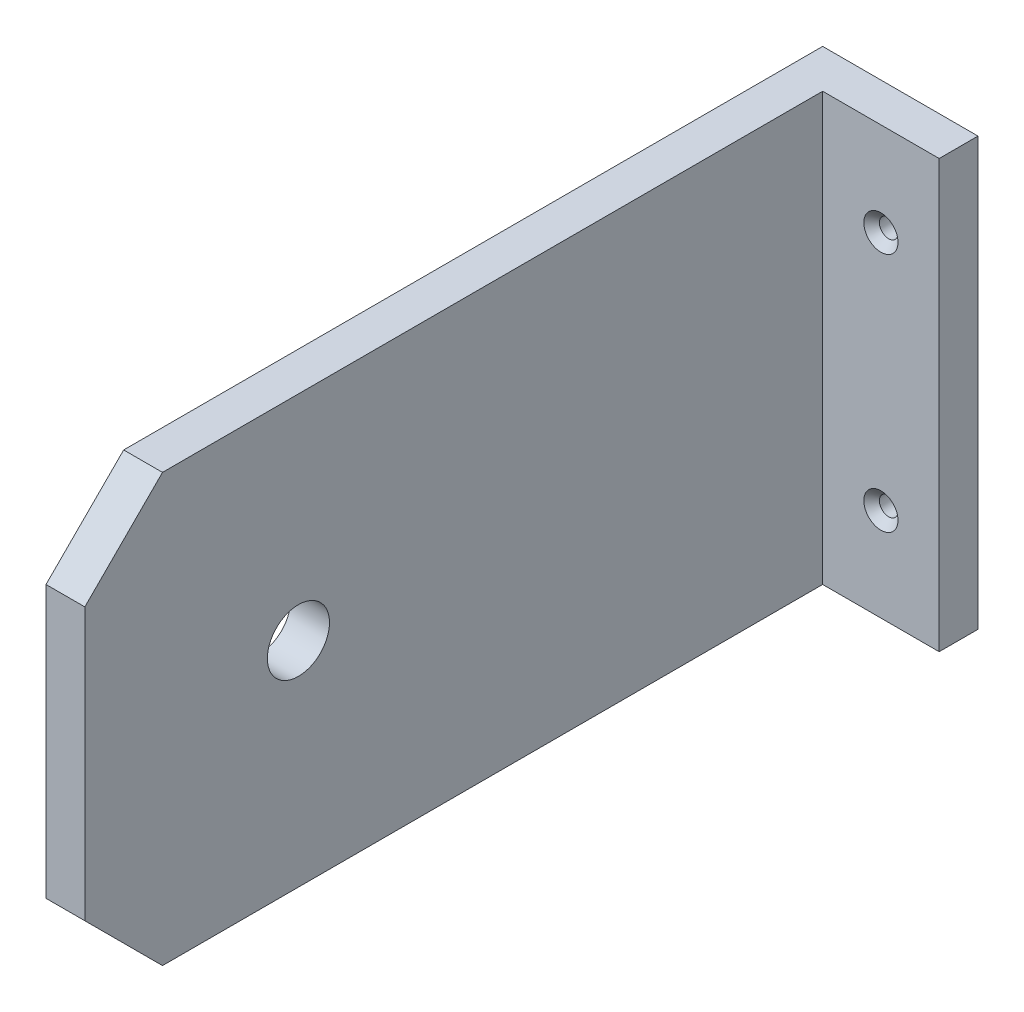
ISO-10303-21;
HEADER;
FILE_DESCRIPTION(('STEP AP214'),'2;1');
FILE_NAME('part.step','',(''),(''),'','','');
FILE_SCHEMA(('AUTOMOTIVE_DESIGN { 1 0 10303 214 1 1 1 1 }'));
ENDSEC;
DATA;
#1=APPLICATION_CONTEXT('core data for automotive mechanical design processes');
#2=APPLICATION_PROTOCOL_DEFINITION('international standard','automotive_design',2000,#1);
#3=PRODUCT_CONTEXT('',#1,'mechanical');
#4=PRODUCT('Part','Part','',(#3));
#5=PRODUCT_RELATED_PRODUCT_CATEGORY('part','',(#4));
#6=PRODUCT_DEFINITION_FORMATION('','',#4);
#7=PRODUCT_DEFINITION_CONTEXT('part definition',#1,'design');
#8=PRODUCT_DEFINITION('design','',#6,#7);
#9=PRODUCT_DEFINITION_SHAPE('','',#8);
#10=(LENGTH_UNIT() NAMED_UNIT(*) SI_UNIT(.MILLI.,.METRE.));
#11=(NAMED_UNIT(*) PLANE_ANGLE_UNIT() SI_UNIT($,.RADIAN.));
#12=(NAMED_UNIT(*) SI_UNIT($,.STERADIAN.) SOLID_ANGLE_UNIT());
#13=UNCERTAINTY_MEASURE_WITH_UNIT(LENGTH_MEASURE(1.E-05),#10,'distance_accuracy_value','');
#14=(GEOMETRIC_REPRESENTATION_CONTEXT(3) GLOBAL_UNCERTAINTY_ASSIGNED_CONTEXT((#13)) GLOBAL_UNIT_ASSIGNED_CONTEXT((#10,
#11,#12)) REPRESENTATION_CONTEXT('',''));
#15=CARTESIAN_POINT('',(0.,0.,0.));
#16=DIRECTION('',(0.,0.,1.));
#17=DIRECTION('',(1.,0.,0.));
#18=AXIS2_PLACEMENT_3D('',#15,#16,#17);
#19=CARTESIAN_POINT('',(5.,27.5,-50.));
#20=DIRECTION('',(0.,0.,1.));
#21=DIRECTION('',(1.,0.,0.));
#22=AXIS2_PLACEMENT_3D('',#19,#20,#21);
#23=PLANE('',#22);
#24=CARTESIAN_POINT('',(12.5,15.5,-50.));
#25=DIRECTION('',(0.,0.,1.));
#26=DIRECTION('',(1.,0.,0.));
#27=AXIS2_PLACEMENT_3D('',#24,#25,#26);
#28=CIRCLE('',#27,1.2);
#29=CARTESIAN_POINT('',(13.7,15.5,-50.));
#30=VERTEX_POINT('',#29);
#31=EDGE_CURVE('E173',#30,#30,#28,.T.);
#32=ORIENTED_EDGE('',*,*,#31,.T.);
#33=EDGE_LOOP('',(#32));
#34=FACE_BOUND('',#33,.T.);
#35=CARTESIAN_POINT('',(12.5,-15.5,-50.));
#36=DIRECTION('',(0.,0.,1.));
#37=DIRECTION('',(1.,0.,0.));
#38=AXIS2_PLACEMENT_3D('',#35,#36,#37);
#39=CIRCLE('',#38,1.2);
#40=CARTESIAN_POINT('',(13.7,-15.5,-50.));
#41=VERTEX_POINT('',#40);
#42=EDGE_CURVE('E164',#41,#41,#39,.T.);
#43=ORIENTED_EDGE('',*,*,#42,.T.);
#44=EDGE_LOOP('',(#43));
#45=FACE_BOUND('',#44,.T.);
#46=DIRECTION('',(0.,1.,0.));
#47=VECTOR('',#46,1.);
#48=CARTESIAN_POINT('',(0.,27.5,-50.));
#49=LINE('',#48,#47);
#50=CARTESIAN_POINT('',(0.,-27.5,-50.));
#51=VERTEX_POINT('',#50);
#52=CARTESIAN_POINT('',(0.,27.5,-50.));
#53=VERTEX_POINT('',#52);
#54=EDGE_CURVE('E128',#51,#53,#49,.T.);
#55=ORIENTED_EDGE('',*,*,#54,.T.);
#56=DIRECTION('',(-1.,0.,0.));
#57=VECTOR('',#56,1.);
#58=CARTESIAN_POINT('',(5.,27.5,-50.));
#59=LINE('',#58,#57);
#60=CARTESIAN_POINT('',(20.,27.5,-50.));
#61=VERTEX_POINT('',#60);
#62=EDGE_CURVE('E11',#61,#53,#59,.T.);
#63=ORIENTED_EDGE('',*,*,#62,.F.);
#64=DIRECTION('',(0.,1.,0.));
#65=VECTOR('',#64,1.);
#66=CARTESIAN_POINT('',(20.,27.5,-50.));
#67=LINE('',#66,#65);
#68=CARTESIAN_POINT('',(20.,-27.5,-50.));
#69=VERTEX_POINT('',#68);
#70=EDGE_CURVE('E142',#69,#61,#67,.T.);
#71=ORIENTED_EDGE('',*,*,#70,.F.);
#72=DIRECTION('',(-1.,0.,0.));
#73=VECTOR('',#72,1.);
#74=CARTESIAN_POINT('',(5.,-27.5,-50.));
#75=LINE('',#74,#73);
#76=EDGE_CURVE('E41',#69,#51,#75,.T.);
#77=ORIENTED_EDGE('',*,*,#76,.T.);
#78=EDGE_LOOP('',(#55,#63,#71,#77));
#79=FACE_BOUND('',#78,.T.);
#80=ADVANCED_FACE('F32',(#34,#45,#79),#23,.F.);
#81=CARTESIAN_POINT('',(5.,27.5,50.));
#82=DIRECTION('',(0.,-1.,0.));
#83=DIRECTION('',(0.,0.,-1.));
#84=AXIS2_PLACEMENT_3D('',#81,#82,#83);
#85=PLANE('',#84);
#86=DIRECTION('',(0.,0.,1.));
#87=VECTOR('',#86,1.);
#88=CARTESIAN_POINT('',(0.,27.5,50.));
#89=LINE('',#88,#87);
#90=CARTESIAN_POINT('',(0.,27.5,40.));
#91=VERTEX_POINT('',#90);
#92=EDGE_CURVE('E131',#53,#91,#89,.T.);
#93=ORIENTED_EDGE('',*,*,#92,.T.);
#94=DIRECTION('',(-1.,0.,0.));
#95=VECTOR('',#94,1.);
#96=CARTESIAN_POINT('',(20.001025,27.5,40.));
#97=LINE('',#96,#95);
#98=CARTESIAN_POINT('',(5.,27.5,40.));
#99=VERTEX_POINT('',#98);
#100=EDGE_CURVE('E57',#99,#91,#97,.T.);
#101=ORIENTED_EDGE('',*,*,#100,.F.);
#102=DIRECTION('',(0.,0.,1.));
#103=VECTOR('',#102,1.);
#104=CARTESIAN_POINT('',(5.,27.5,50.));
#105=LINE('',#104,#103);
#106=CARTESIAN_POINT('',(5.,27.5,-45.));
#107=VERTEX_POINT('',#106);
#108=EDGE_CURVE('E119',#107,#99,#105,.T.);
#109=ORIENTED_EDGE('',*,*,#108,.F.);
#110=DIRECTION('',(-1.,0.,0.));
#111=VECTOR('',#110,1.);
#112=CARTESIAN_POINT('',(20.,27.5,-45.));
#113=LINE('',#112,#111);
#114=CARTESIAN_POINT('',(20.,27.5,-45.));
#115=VERTEX_POINT('',#114);
#116=EDGE_CURVE('E132',#115,#107,#113,.T.);
#117=ORIENTED_EDGE('',*,*,#116,.F.);
#118=DIRECTION('',(0.,0.,1.));
#119=VECTOR('',#118,1.);
#120=CARTESIAN_POINT('',(20.,27.5,-50.));
#121=LINE('',#120,#119);
#122=EDGE_CURVE('E153',#61,#115,#121,.T.);
#123=ORIENTED_EDGE('',*,*,#122,.F.);
#124=ORIENTED_EDGE('',*,*,#62,.T.);
#125=EDGE_LOOP('',(#93,#101,#109,#117,#123,#124));
#126=FACE_BOUND('',#125,.T.);
#127=ADVANCED_FACE('F217',(#126),#85,.F.);
#128=CARTESIAN_POINT('',(5.,27.5,50.));
#129=DIRECTION('',(0.,0.,-1.));
#130=DIRECTION('',(0.,1.,0.));
#131=AXIS2_PLACEMENT_3D('',#128,#129,#130);
#132=PLANE('',#131);
#133=DIRECTION('',(0.,-1.,0.));
#134=VECTOR('',#133,1.);
#135=CARTESIAN_POINT('',(0.,27.5,50.));
#136=LINE('',#135,#134);
#137=CARTESIAN_POINT('',(0.,17.4999999999999,50.));
#138=VERTEX_POINT('',#137);
#139=CARTESIAN_POINT('',(0.,-17.5,50.));
#140=VERTEX_POINT('',#139);
#141=EDGE_CURVE('E113',#138,#140,#136,.T.);
#142=ORIENTED_EDGE('',*,*,#141,.T.);
#143=DIRECTION('',(-1.,0.,0.));
#144=VECTOR('',#143,1.);
#145=CARTESIAN_POINT('',(20.001025,-17.5,50.));
#146=LINE('',#145,#144);
#147=CARTESIAN_POINT('',(5.,-17.5,50.));
#148=VERTEX_POINT('',#147);
#149=EDGE_CURVE('E49',#148,#140,#146,.T.);
#150=ORIENTED_EDGE('',*,*,#149,.F.);
#151=DIRECTION('',(0.,-1.,0.));
#152=VECTOR('',#151,1.);
#153=CARTESIAN_POINT('',(5.,27.5,50.));
#154=LINE('',#153,#152);
#155=CARTESIAN_POINT('',(5.,17.4999999999999,50.));
#156=VERTEX_POINT('',#155);
#157=EDGE_CURVE('E111',#156,#148,#154,.T.);
#158=ORIENTED_EDGE('',*,*,#157,.F.);
#159=DIRECTION('',(-1.,0.,0.));
#160=VECTOR('',#159,1.);
#161=CARTESIAN_POINT('',(20.001025,17.4999999999999,50.));
#162=LINE('',#161,#160);
#163=EDGE_CURVE('E143',#156,#138,#162,.T.);
#164=ORIENTED_EDGE('',*,*,#163,.T.);
#165=EDGE_LOOP('',(#142,#150,#158,#164));
#166=FACE_BOUND('',#165,.T.);
#167=ADVANCED_FACE('F109',(#166),#132,.F.);
#168=CARTESIAN_POINT('',(5.,-27.5,50.));
#169=DIRECTION('',(0.,1.,0.));
#170=DIRECTION('',(0.,0.,1.));
#171=AXIS2_PLACEMENT_3D('',#168,#169,#170);
#172=PLANE('',#171);
#173=DIRECTION('',(0.,0.,-1.));
#174=VECTOR('',#173,1.);
#175=CARTESIAN_POINT('',(5.,-27.5,50.));
#176=LINE('',#175,#174);
#177=CARTESIAN_POINT('',(5.,-27.5,39.9999999999999));
#178=VERTEX_POINT('',#177);
#179=CARTESIAN_POINT('',(5.,-27.5,-45.));
#180=VERTEX_POINT('',#179);
#181=EDGE_CURVE('E35',#178,#180,#176,.T.);
#182=ORIENTED_EDGE('',*,*,#181,.F.);
#183=DIRECTION('',(-1.,0.,0.));
#184=VECTOR('',#183,1.);
#185=CARTESIAN_POINT('',(20.001025,-27.5,39.9999999999999));
#186=LINE('',#185,#184);
#187=CARTESIAN_POINT('',(0.,-27.5,39.9999999999999));
#188=VERTEX_POINT('',#187);
#189=EDGE_CURVE('E100',#178,#188,#186,.T.);
#190=ORIENTED_EDGE('',*,*,#189,.T.);
#191=DIRECTION('',(0.,0.,-1.));
#192=VECTOR('',#191,1.);
#193=CARTESIAN_POINT('',(0.,-27.5,50.));
#194=LINE('',#193,#192);
#195=EDGE_CURVE('E121',#188,#51,#194,.T.);
#196=ORIENTED_EDGE('',*,*,#195,.T.);
#197=ORIENTED_EDGE('',*,*,#76,.F.);
#198=DIRECTION('',(0.,0.,-1.));
#199=VECTOR('',#198,1.);
#200=CARTESIAN_POINT('',(20.,-27.5,-50.));
#201=LINE('',#200,#199);
#202=CARTESIAN_POINT('',(20.,-27.5,-45.));
#203=VERTEX_POINT('',#202);
#204=EDGE_CURVE('E148',#203,#69,#201,.T.);
#205=ORIENTED_EDGE('',*,*,#204,.F.);
#206=DIRECTION('',(-1.,0.,0.));
#207=VECTOR('',#206,1.);
#208=CARTESIAN_POINT('',(20.,-27.5,-45.));
#209=LINE('',#208,#207);
#210=EDGE_CURVE('E144',#203,#180,#209,.T.);
#211=ORIENTED_EDGE('',*,*,#210,.T.);
#212=EDGE_LOOP('',(#182,#190,#196,#197,#205,#211));
#213=FACE_BOUND('',#212,.T.);
#214=ADVANCED_FACE('F199',(#213),#172,.F.);
#215=CARTESIAN_POINT('',(5.,0.,0.));
#216=DIRECTION('',(1.,0.,0.));
#217=DIRECTION('',(0.,0.,-1.));
#218=AXIS2_PLACEMENT_3D('',#215,#216,#217);
#219=PLANE('',#218);
#220=CARTESIAN_POINT('',(5.,0.,22.5));
#221=DIRECTION('',(1.,0.,0.));
#222=DIRECTION('',(0.,0.,-1.));
#223=AXIS2_PLACEMENT_3D('',#220,#221,#222);
#224=CIRCLE('',#223,4.);
#225=CARTESIAN_POINT('',(5.,0.,18.5));
#226=VERTEX_POINT('',#225);
#227=EDGE_CURVE('E183',#226,#226,#224,.F.);
#228=ORIENTED_EDGE('',*,*,#227,.T.);
#229=EDGE_LOOP('',(#228));
#230=FACE_BOUND('',#229,.T.);
#231=DIRECTION('',(0.,-0.707106781186544,-0.707106781186551));
#232=VECTOR('',#231,1.);
#233=CARTESIAN_POINT('',(5.,-27.5,39.9999999999999));
#234=LINE('',#233,#232);
#235=EDGE_CURVE('E97',#148,#178,#234,.T.);
#236=ORIENTED_EDGE('',*,*,#235,.T.);
#237=ORIENTED_EDGE('',*,*,#181,.T.);
#238=DIRECTION('',(0.,-1.,0.));
#239=VECTOR('',#238,1.);
#240=CARTESIAN_POINT('',(5.,27.5,-45.));
#241=LINE('',#240,#239);
#242=EDGE_CURVE('E139',#107,#180,#241,.T.);
#243=ORIENTED_EDGE('',*,*,#242,.F.);
#244=ORIENTED_EDGE('',*,*,#108,.T.);
#245=DIRECTION('',(0.,-0.707106781186551,0.707106781186544));
#246=VECTOR('',#245,1.);
#247=CARTESIAN_POINT('',(5.,27.5,40.));
#248=LINE('',#247,#246);
#249=EDGE_CURVE('E104',#99,#156,#248,.T.);
#250=ORIENTED_EDGE('',*,*,#249,.T.);
#251=ORIENTED_EDGE('',*,*,#157,.T.);
#252=EDGE_LOOP('',(#236,#237,#243,#244,#250,#251));
#253=FACE_BOUND('',#252,.T.);
#254=ADVANCED_FACE('F117',(#230,#253),#219,.T.);
#255=CARTESIAN_POINT('',(0.,0.,0.));
#256=DIRECTION('',(1.,0.,0.));
#257=DIRECTION('',(0.,0.,-1.));
#258=AXIS2_PLACEMENT_3D('',#255,#256,#257);
#259=PLANE('',#258);
#260=CARTESIAN_POINT('',(0.,0.,22.5));
#261=DIRECTION('',(-1.,0.,0.));
#262=DIRECTION('',(0.,0.,1.));
#263=AXIS2_PLACEMENT_3D('',#260,#261,#262);
#264=CIRCLE('',#263,4.);
#265=CARTESIAN_POINT('',(0.,0.,26.5));
#266=VERTEX_POINT('',#265);
#267=EDGE_CURVE('E182',#266,#266,#264,.T.);
#268=ORIENTED_EDGE('',*,*,#267,.F.);
#269=EDGE_LOOP('',(#268));
#270=FACE_BOUND('',#269,.T.);
#271=ORIENTED_EDGE('',*,*,#195,.F.);
#272=DIRECTION('',(0.,-0.707106781186544,-0.707106781186551));
#273=VECTOR('',#272,1.);
#274=CARTESIAN_POINT('',(0.,-27.5,39.9999999999999));
#275=LINE('',#274,#273);
#276=EDGE_CURVE('E114',#140,#188,#275,.T.);
#277=ORIENTED_EDGE('',*,*,#276,.F.);
#278=ORIENTED_EDGE('',*,*,#141,.F.);
#279=DIRECTION('',(0.,-0.707106781186551,0.707106781186544));
#280=VECTOR('',#279,1.);
#281=CARTESIAN_POINT('',(0.,27.5,40.));
#282=LINE('',#281,#280);
#283=EDGE_CURVE('E158',#91,#138,#282,.T.);
#284=ORIENTED_EDGE('',*,*,#283,.F.);
#285=ORIENTED_EDGE('',*,*,#92,.F.);
#286=ORIENTED_EDGE('',*,*,#54,.F.);
#287=EDGE_LOOP('',(#271,#277,#278,#284,#285,#286));
#288=FACE_BOUND('',#287,.T.);
#289=ADVANCED_FACE('F191',(#270,#288),#259,.F.);
#290=CARTESIAN_POINT('',(20.,27.5,-45.));
#291=DIRECTION('',(0.,0.,-1.));
#292=DIRECTION('',(0.,1.,0.));
#293=AXIS2_PLACEMENT_3D('',#290,#291,#292);
#294=PLANE('',#293);
#295=CARTESIAN_POINT('',(12.5,15.5,-45.));
#296=DIRECTION('',(0.,0.,1.));
#297=DIRECTION('',(1.,0.,0.));
#298=AXIS2_PLACEMENT_3D('',#295,#296,#297);
#299=CIRCLE('',#298,2.2);
#300=CARTESIAN_POINT('',(14.7,15.5,-45.));
#301=VERTEX_POINT('',#300);
#302=EDGE_CURVE('E179',#301,#301,#299,.T.);
#303=ORIENTED_EDGE('',*,*,#302,.F.);
#304=EDGE_LOOP('',(#303));
#305=FACE_BOUND('',#304,.T.);
#306=CARTESIAN_POINT('',(12.5,-15.5,-45.));
#307=DIRECTION('',(0.,0.,1.));
#308=DIRECTION('',(1.,0.,0.));
#309=AXIS2_PLACEMENT_3D('',#306,#307,#308);
#310=CIRCLE('',#309,2.2);
#311=CARTESIAN_POINT('',(14.7,-15.5,-45.));
#312=VERTEX_POINT('',#311);
#313=EDGE_CURVE('E170',#312,#312,#310,.T.);
#314=ORIENTED_EDGE('',*,*,#313,.F.);
#315=EDGE_LOOP('',(#314));
#316=FACE_BOUND('',#315,.T.);
#317=ORIENTED_EDGE('',*,*,#242,.T.);
#318=ORIENTED_EDGE('',*,*,#210,.F.);
#319=DIRECTION('',(0.,-1.,0.));
#320=VECTOR('',#319,1.);
#321=CARTESIAN_POINT('',(20.,27.5,-45.));
#322=LINE('',#321,#320);
#323=EDGE_CURVE('E151',#115,#203,#322,.T.);
#324=ORIENTED_EDGE('',*,*,#323,.F.);
#325=ORIENTED_EDGE('',*,*,#116,.T.);
#326=EDGE_LOOP('',(#317,#318,#324,#325));
#327=FACE_BOUND('',#326,.T.);
#328=ADVANCED_FACE('F194',(#305,#316,#327),#294,.F.);
#329=CARTESIAN_POINT('',(20.,0.,0.));
#330=DIRECTION('',(-1.,0.,0.));
#331=DIRECTION('',(0.,0.,1.));
#332=AXIS2_PLACEMENT_3D('',#329,#330,#331);
#333=PLANE('',#332);
#334=ORIENTED_EDGE('',*,*,#70,.T.);
#335=ORIENTED_EDGE('',*,*,#122,.T.);
#336=ORIENTED_EDGE('',*,*,#323,.T.);
#337=ORIENTED_EDGE('',*,*,#204,.T.);
#338=EDGE_LOOP('',(#334,#335,#336,#337));
#339=FACE_BOUND('',#338,.T.);
#340=ADVANCED_FACE('F205',(#339),#333,.F.);
#341=CARTESIAN_POINT('',(20.001025,27.5,40.));
#342=DIRECTION('',(0.,-0.707106781186544,-0.707106781186551));
#343=DIRECTION('',(0.,0.707106781186551,-0.707106781186544));
#344=AXIS2_PLACEMENT_3D('',#341,#342,#343);
#345=PLANE('',#344);
#346=ORIENTED_EDGE('',*,*,#100,.T.);
#347=ORIENTED_EDGE('',*,*,#283,.T.);
#348=ORIENTED_EDGE('',*,*,#163,.F.);
#349=ORIENTED_EDGE('',*,*,#249,.F.);
#350=EDGE_LOOP('',(#346,#347,#348,#349));
#351=FACE_BOUND('',#350,.T.);
#352=ADVANCED_FACE('F218',(#351),#345,.F.);
#353=CARTESIAN_POINT('',(20.001025,-27.5,39.9999999999999));
#354=DIRECTION('',(0.,0.707106781186551,-0.707106781186544));
#355=DIRECTION('',(0.,0.707106781186544,0.707106781186551));
#356=AXIS2_PLACEMENT_3D('',#353,#354,#355);
#357=PLANE('',#356);
#358=ORIENTED_EDGE('',*,*,#149,.T.);
#359=ORIENTED_EDGE('',*,*,#276,.T.);
#360=ORIENTED_EDGE('',*,*,#189,.F.);
#361=ORIENTED_EDGE('',*,*,#235,.F.);
#362=EDGE_LOOP('',(#358,#359,#360,#361));
#363=FACE_BOUND('',#362,.T.);
#364=ADVANCED_FACE('F98',(#363),#357,.F.);
#365=CARTESIAN_POINT('',(12.5,-15.5,-45.));
#366=DIRECTION('',(0.,0.,1.));
#367=DIRECTION('',(1.,0.,0.));
#368=AXIS2_PLACEMENT_3D('',#365,#366,#367);
#369=CYLINDRICAL_SURFACE('',#368,1.2);
#370=ORIENTED_EDGE('',*,*,#42,.F.);
#371=EDGE_LOOP('',(#370));
#372=FACE_BOUND('',#371,.T.);
#373=CARTESIAN_POINT('',(12.5,-15.5,-46.));
#374=DIRECTION('',(0.,0.,1.));
#375=DIRECTION('',(1.,0.,0.));
#376=AXIS2_PLACEMENT_3D('',#373,#374,#375);
#377=CIRCLE('',#376,1.2);
#378=CARTESIAN_POINT('',(13.7,-15.5,-46.));
#379=VERTEX_POINT('',#378);
#380=EDGE_CURVE('E167',#379,#379,#377,.T.);
#381=ORIENTED_EDGE('',*,*,#380,.T.);
#382=EDGE_LOOP('',(#381));
#383=FACE_BOUND('',#382,.T.);
#384=ADVANCED_FACE('F225',(#372,#383),#369,.F.);
#385=CARTESIAN_POINT('',(12.5,-15.5,-45.));
#386=DIRECTION('',(0.,0.,1.));
#387=DIRECTION('',(1.,0.,0.));
#388=AXIS2_PLACEMENT_3D('',#385,#386,#387);
#389=CONICAL_SURFACE('',#388,2.2,0.785398163397448);
#390=ORIENTED_EDGE('',*,*,#380,.F.);
#391=EDGE_LOOP('',(#390));
#392=FACE_BOUND('',#391,.T.);
#393=ORIENTED_EDGE('',*,*,#313,.T.);
#394=EDGE_LOOP('',(#393));
#395=FACE_BOUND('',#394,.T.);
#396=ADVANCED_FACE('F239',(#392,#395),#389,.F.);
#397=CARTESIAN_POINT('',(12.5,15.5,-45.));
#398=DIRECTION('',(0.,0.,1.));
#399=DIRECTION('',(1.,0.,0.));
#400=AXIS2_PLACEMENT_3D('',#397,#398,#399);
#401=CYLINDRICAL_SURFACE('',#400,1.2);
#402=ORIENTED_EDGE('',*,*,#31,.F.);
#403=EDGE_LOOP('',(#402));
#404=FACE_BOUND('',#403,.T.);
#405=CARTESIAN_POINT('',(12.5,15.5,-46.));
#406=DIRECTION('',(0.,0.,1.));
#407=DIRECTION('',(1.,0.,0.));
#408=AXIS2_PLACEMENT_3D('',#405,#406,#407);
#409=CIRCLE('',#408,1.2);
#410=CARTESIAN_POINT('',(13.7,15.5,-46.));
#411=VERTEX_POINT('',#410);
#412=EDGE_CURVE('E176',#411,#411,#409,.T.);
#413=ORIENTED_EDGE('',*,*,#412,.T.);
#414=EDGE_LOOP('',(#413));
#415=FACE_BOUND('',#414,.T.);
#416=ADVANCED_FACE('F245',(#404,#415),#401,.F.);
#417=CARTESIAN_POINT('',(12.5,15.5,-45.));
#418=DIRECTION('',(0.,0.,1.));
#419=DIRECTION('',(1.,0.,0.));
#420=AXIS2_PLACEMENT_3D('',#417,#418,#419);
#421=CONICAL_SURFACE('',#420,2.2,0.785398163397448);
#422=ORIENTED_EDGE('',*,*,#412,.F.);
#423=EDGE_LOOP('',(#422));
#424=FACE_BOUND('',#423,.T.);
#425=ORIENTED_EDGE('',*,*,#302,.T.);
#426=EDGE_LOOP('',(#425));
#427=FACE_BOUND('',#426,.T.);
#428=ADVANCED_FACE('F288',(#424,#427),#421,.F.);
#429=CARTESIAN_POINT('',(20.001025,0.,22.5));
#430=DIRECTION('',(-1.,0.,0.));
#431=DIRECTION('',(0.,0.,1.));
#432=AXIS2_PLACEMENT_3D('',#429,#430,#431);
#433=CYLINDRICAL_SURFACE('',#432,4.);
#434=ORIENTED_EDGE('',*,*,#227,.F.);
#435=EDGE_LOOP('',(#434));
#436=FACE_BOUND('',#435,.T.);
#437=ORIENTED_EDGE('',*,*,#267,.T.);
#438=EDGE_LOOP('',(#437));
#439=FACE_BOUND('',#438,.T.);
#440=ADVANCED_FACE('F189',(#436,#439),#433,.F.);
#441=CLOSED_SHELL('',(#80,#127,#167,#214,#254,#289,#328,#340,#352,#364,#384,#396,#416,#428,#440));
#442=MANIFOLD_SOLID_BREP('B2',#441);
#443=ADVANCED_BREP_SHAPE_REPRESENTATION('',(#18,#442),#14);
#444=SHAPE_DEFINITION_REPRESENTATION(#9,#443);
ENDSEC;
END-ISO-10303-21;
